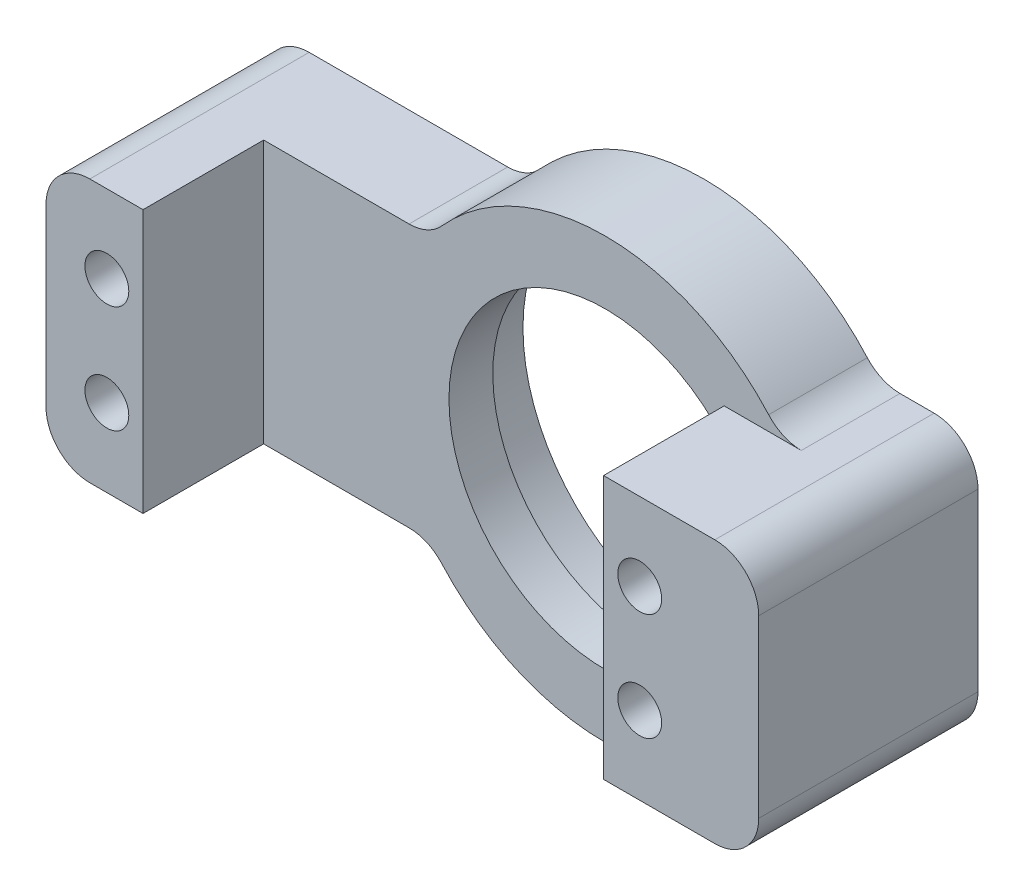
ISO-10303-21;
HEADER;
FILE_DESCRIPTION(('STEP AP214'),'2;1');
FILE_NAME('part.step','',(''),(''),'','','');
FILE_SCHEMA(('AUTOMOTIVE_DESIGN { 1 0 10303 214 1 1 1 1 }'));
ENDSEC;
DATA;
#1=APPLICATION_CONTEXT('core data for automotive mechanical design processes');
#2=APPLICATION_PROTOCOL_DEFINITION('international standard','automotive_design',2000,#1);
#3=PRODUCT_CONTEXT('',#1,'mechanical');
#4=PRODUCT('Part','Part','',(#3));
#5=PRODUCT_RELATED_PRODUCT_CATEGORY('part','',(#4));
#6=PRODUCT_DEFINITION_FORMATION('','',#4);
#7=PRODUCT_DEFINITION_CONTEXT('part definition',#1,'design');
#8=PRODUCT_DEFINITION('design','',#6,#7);
#9=PRODUCT_DEFINITION_SHAPE('','',#8);
#10=(LENGTH_UNIT() NAMED_UNIT(*) SI_UNIT(.MILLI.,.METRE.));
#11=(NAMED_UNIT(*) PLANE_ANGLE_UNIT() SI_UNIT($,.RADIAN.));
#12=(NAMED_UNIT(*) SI_UNIT($,.STERADIAN.) SOLID_ANGLE_UNIT());
#13=UNCERTAINTY_MEASURE_WITH_UNIT(LENGTH_MEASURE(1.E-05),#10,'distance_accuracy_value','');
#14=(GEOMETRIC_REPRESENTATION_CONTEXT(3) GLOBAL_UNCERTAINTY_ASSIGNED_CONTEXT((#13)) GLOBAL_UNIT_ASSIGNED_CONTEXT((#10,
#11,#12)) REPRESENTATION_CONTEXT('',''));
#15=CARTESIAN_POINT('',(0.,0.,0.));
#16=DIRECTION('',(0.,0.,1.));
#17=DIRECTION('',(1.,0.,0.));
#18=AXIS2_PLACEMENT_3D('',#15,#16,#17);
#19=CARTESIAN_POINT('',(0.,113.007283518404,9.));
#20=DIRECTION('',(0.,0.,1.));
#21=DIRECTION('',(1.,0.,0.));
#22=AXIS2_PLACEMENT_3D('',#19,#20,#21);
#23=PLANE('',#22);
#24=CARTESIAN_POINT('',(0.,113.007283518404,9.));
#25=DIRECTION('',(0.,0.,1.));
#26=DIRECTION('',(1.,0.,0.));
#27=AXIS2_PLACEMENT_3D('',#24,#25,#26);
#28=CIRCLE('',#27,20.);
#29=CARTESIAN_POINT('',(14.9071198499986,126.340616851737,9.));
#30=VERTEX_POINT('',#29);
#31=CARTESIAN_POINT('',(-14.9071198499986,126.340616851737,9.));
#32=VERTEX_POINT('',#31);
#33=EDGE_CURVE('E250',#30,#32,#28,.T.);
#34=ORIENTED_EDGE('',*,*,#33,.T.);
#35=CARTESIAN_POINT('',(-17.8885438199983,129.007283518404,9.));
#36=DIRECTION('',(0.,0.,1.));
#37=DIRECTION('',(1.,0.,0.));
#38=AXIS2_PLACEMENT_3D('',#35,#36,#37);
#39=CIRCLE('',#38,4.);
#40=CARTESIAN_POINT('',(-17.8885438199983,125.007283518404,9.));
#41=VERTEX_POINT('',#40);
#42=EDGE_CURVE('E341',#32,#41,#39,.F.);
#43=ORIENTED_EDGE('',*,*,#42,.T.);
#44=DIRECTION('',(-1.,0.,0.));
#45=VECTOR('',#44,1.);
#46=CARTESIAN_POINT('',(-16.,125.007283518404,9.));
#47=LINE('',#46,#45);
#48=CARTESIAN_POINT('',(-31.1499999999761,125.007283518404,9.));
#49=VERTEX_POINT('',#48);
#50=EDGE_CURVE('E253',#41,#49,#47,.T.);
#51=ORIENTED_EDGE('',*,*,#50,.T.);
#52=DIRECTION('',(0.,1.,0.));
#53=VECTOR('',#52,1.);
#54=CARTESIAN_POINT('',(-31.1499999999761,125.007283518404,9.));
#55=LINE('',#54,#53);
#56=CARTESIAN_POINT('',(-31.1499999999761,101.007283518404,9.));
#57=VERTEX_POINT('',#56);
#58=EDGE_CURVE('E211',#57,#49,#55,.T.);
#59=ORIENTED_EDGE('',*,*,#58,.F.);
#60=DIRECTION('',(1.,0.,0.));
#61=VECTOR('',#60,1.);
#62=CARTESIAN_POINT('',(-40.,101.007283518404,9.));
#63=LINE('',#62,#61);
#64=CARTESIAN_POINT('',(-17.8885438199984,101.007283518404,9.));
#65=VERTEX_POINT('',#64);
#66=EDGE_CURVE('E197',#57,#65,#63,.T.);
#67=ORIENTED_EDGE('',*,*,#66,.T.);
#68=CARTESIAN_POINT('',(-17.8885438199984,97.0072835184039,9.));
#69=DIRECTION('',(0.,0.,1.));
#70=DIRECTION('',(1.,0.,0.));
#71=AXIS2_PLACEMENT_3D('',#68,#69,#70);
#72=CIRCLE('',#71,4.);
#73=CARTESIAN_POINT('',(-14.9071198499986,99.6739501850705,9.));
#74=VERTEX_POINT('',#73);
#75=EDGE_CURVE('E345',#65,#74,#72,.F.);
#76=ORIENTED_EDGE('',*,*,#75,.T.);
#77=CARTESIAN_POINT('',(0.,113.007283518404,9.));
#78=DIRECTION('',(0.,0.,1.));
#79=DIRECTION('',(1.,0.,0.));
#80=AXIS2_PLACEMENT_3D('',#77,#78,#79);
#81=CIRCLE('',#80,20.);
#82=CARTESIAN_POINT('',(14.9071198499986,99.6739501850705,9.));
#83=VERTEX_POINT('',#82);
#84=EDGE_CURVE('E247',#74,#83,#81,.T.);
#85=ORIENTED_EDGE('',*,*,#84,.T.);
#86=CARTESIAN_POINT('',(17.8885438199983,97.0072835184039,9.));
#87=DIRECTION('',(0.,0.,1.));
#88=DIRECTION('',(1.,0.,0.));
#89=AXIS2_PLACEMENT_3D('',#86,#87,#88);
#90=CIRCLE('',#89,4.);
#91=CARTESIAN_POINT('',(17.8885438199983,101.007283518404,9.));
#92=VERTEX_POINT('',#91);
#93=EDGE_CURVE('E11',#83,#92,#90,.F.);
#94=ORIENTED_EDGE('',*,*,#93,.T.);
#95=DIRECTION('',(1.,0.,0.));
#96=VECTOR('',#95,1.);
#97=CARTESIAN_POINT('',(25.,101.007283518404,9.));
#98=LINE('',#97,#96);
#99=CARTESIAN_POINT('',(10.8500000000239,101.007283518404,9.));
#100=VERTEX_POINT('',#99);
#101=EDGE_CURVE('E218',#100,#92,#98,.T.);
#102=ORIENTED_EDGE('',*,*,#101,.F.);
#103=DIRECTION('',(0.,-1.,0.));
#104=VECTOR('',#103,1.);
#105=CARTESIAN_POINT('',(10.8500000000239,101.007283518404,9.));
#106=LINE('',#105,#104);
#107=CARTESIAN_POINT('',(10.8500000000239,103.769318374527,9.));
#108=VERTEX_POINT('',#107);
#109=EDGE_CURVE('E228',#108,#100,#106,.T.);
#110=ORIENTED_EDGE('',*,*,#109,.F.);
#111=CARTESIAN_POINT('',(0.,113.007283518404,9.));
#112=DIRECTION('',(0.,0.,1.));
#113=DIRECTION('',(1.,0.,0.));
#114=AXIS2_PLACEMENT_3D('',#111,#112,#113);
#115=CIRCLE('',#114,14.25);
#116=CARTESIAN_POINT('',(10.8500000000239,122.245248662281,9.));
#117=VERTEX_POINT('',#116);
#118=EDGE_CURVE('E240',#117,#108,#115,.T.);
#119=ORIENTED_EDGE('',*,*,#118,.F.);
#120=CARTESIAN_POINT('',(10.8500000000239,125.007283518404,9.));
#121=VERTEX_POINT('',#120);
#122=EDGE_CURVE('E230',#121,#117,#106,.T.);
#123=ORIENTED_EDGE('',*,*,#122,.F.);
#124=DIRECTION('',(-1.,0.,0.));
#125=VECTOR('',#124,1.);
#126=CARTESIAN_POINT('',(25.,125.007283518404,9.));
#127=LINE('',#126,#125);
#128=CARTESIAN_POINT('',(17.8885438199983,125.007283518404,9.));
#129=VERTEX_POINT('',#128);
#130=EDGE_CURVE('E225',#129,#121,#127,.T.);
#131=ORIENTED_EDGE('',*,*,#130,.F.);
#132=CARTESIAN_POINT('',(17.8885438199983,129.007283518404,9.));
#133=DIRECTION('',(0.,0.,1.));
#134=DIRECTION('',(1.,0.,0.));
#135=AXIS2_PLACEMENT_3D('',#132,#133,#134);
#136=CIRCLE('',#135,4.);
#137=EDGE_CURVE('E337',#129,#30,#136,.F.);
#138=ORIENTED_EDGE('',*,*,#137,.T.);
#139=EDGE_LOOP('',(#34,#43,#51,#59,#67,#76,#85,#94,#102,#110,#119,#123,#131,#138));
#140=FACE_BOUND('',#139,.T.);
#141=ADVANCED_FACE('F32',(#140),#23,.T.);
#142=CARTESIAN_POINT('',(0.,113.007283518404,0.));
#143=DIRECTION('',(0.,0.,1.));
#144=DIRECTION('',(1.,0.,0.));
#145=AXIS2_PLACEMENT_3D('',#142,#143,#144);
#146=PLANE('',#145);
#147=DIRECTION('',(1.,0.,0.));
#148=VECTOR('',#147,1.);
#149=CARTESIAN_POINT('',(-40.,101.007283518404,0.));
#150=LINE('',#149,#148);
#151=CARTESIAN_POINT('',(-36.,101.007283518404,0.));
#152=VERTEX_POINT('',#151);
#153=CARTESIAN_POINT('',(-17.8885438199984,101.007283518404,0.));
#154=VERTEX_POINT('',#153);
#155=EDGE_CURVE('E264',#152,#154,#150,.T.);
#156=ORIENTED_EDGE('',*,*,#155,.F.);
#157=CARTESIAN_POINT('',(-36.,105.007283518404,0.));
#158=DIRECTION('',(0.,0.,1.));
#159=DIRECTION('',(1.,0.,0.));
#160=AXIS2_PLACEMENT_3D('',#157,#158,#159);
#161=CIRCLE('',#160,4.);
#162=CARTESIAN_POINT('',(-40.,105.007283518404,0.));
#163=VERTEX_POINT('',#162);
#164=EDGE_CURVE('E318',#152,#163,#161,.F.);
#165=ORIENTED_EDGE('',*,*,#164,.T.);
#166=DIRECTION('',(0.,-1.,0.));
#167=VECTOR('',#166,1.);
#168=CARTESIAN_POINT('',(-40.,125.007283518404,0.));
#169=LINE('',#168,#167);
#170=CARTESIAN_POINT('',(-40.,121.007283518404,0.));
#171=VERTEX_POINT('',#170);
#172=EDGE_CURVE('E261',#171,#163,#169,.T.);
#173=ORIENTED_EDGE('',*,*,#172,.F.);
#174=CARTESIAN_POINT('',(-36.,121.007283518404,0.));
#175=DIRECTION('',(0.,0.,1.));
#176=DIRECTION('',(1.,0.,0.));
#177=AXIS2_PLACEMENT_3D('',#174,#175,#176);
#178=CIRCLE('',#177,4.);
#179=CARTESIAN_POINT('',(-36.,125.007283518404,0.));
#180=VERTEX_POINT('',#179);
#181=EDGE_CURVE('E316',#171,#180,#178,.F.);
#182=ORIENTED_EDGE('',*,*,#181,.T.);
#183=DIRECTION('',(-1.,0.,0.));
#184=VECTOR('',#183,1.);
#185=CARTESIAN_POINT('',(-40.,125.007283518404,0.));
#186=LINE('',#185,#184);
#187=CARTESIAN_POINT('',(-17.8885438199983,125.007283518404,0.));
#188=VERTEX_POINT('',#187);
#189=EDGE_CURVE('E229',#188,#180,#186,.T.);
#190=ORIENTED_EDGE('',*,*,#189,.F.);
#191=CARTESIAN_POINT('',(-17.8885438199983,129.007283518404,0.));
#192=DIRECTION('',(0.,0.,1.));
#193=DIRECTION('',(1.,0.,0.));
#194=AXIS2_PLACEMENT_3D('',#191,#192,#193);
#195=CIRCLE('',#194,4.);
#196=CARTESIAN_POINT('',(-14.9071198499986,126.340616851737,0.));
#197=VERTEX_POINT('',#196);
#198=EDGE_CURVE('E339',#188,#197,#195,.T.);
#199=ORIENTED_EDGE('',*,*,#198,.T.);
#200=CARTESIAN_POINT('',(0.,113.007283518404,0.));
#201=DIRECTION('',(0.,0.,1.));
#202=DIRECTION('',(1.,0.,0.));
#203=AXIS2_PLACEMENT_3D('',#200,#201,#202);
#204=CIRCLE('',#203,20.);
#205=CARTESIAN_POINT('',(14.9071198499986,126.340616851737,0.));
#206=VERTEX_POINT('',#205);
#207=EDGE_CURVE('E277',#206,#197,#204,.T.);
#208=ORIENTED_EDGE('',*,*,#207,.F.);
#209=CARTESIAN_POINT('',(17.8885438199983,129.007283518404,0.));
#210=DIRECTION('',(0.,0.,1.));
#211=DIRECTION('',(1.,0.,0.));
#212=AXIS2_PLACEMENT_3D('',#209,#210,#211);
#213=CIRCLE('',#212,4.);
#214=CARTESIAN_POINT('',(17.8885438199983,125.007283518404,0.));
#215=VERTEX_POINT('',#214);
#216=EDGE_CURVE('E335',#206,#215,#213,.T.);
#217=ORIENTED_EDGE('',*,*,#216,.T.);
#218=DIRECTION('',(-1.,0.,0.));
#219=VECTOR('',#218,1.);
#220=CARTESIAN_POINT('',(16.,125.007283518404,0.));
#221=LINE('',#220,#219);
#222=CARTESIAN_POINT('',(21.,125.007283518404,0.));
#223=VERTEX_POINT('',#222);
#224=EDGE_CURVE('E274',#223,#215,#221,.T.);
#225=ORIENTED_EDGE('',*,*,#224,.F.);
#226=CARTESIAN_POINT('',(21.,121.007283518404,0.));
#227=DIRECTION('',(0.,0.,1.));
#228=DIRECTION('',(1.,0.,0.));
#229=AXIS2_PLACEMENT_3D('',#226,#227,#228);
#230=CIRCLE('',#229,4.);
#231=CARTESIAN_POINT('',(25.,121.007283518404,0.));
#232=VERTEX_POINT('',#231);
#233=EDGE_CURVE('E314',#223,#232,#230,.F.);
#234=ORIENTED_EDGE('',*,*,#233,.T.);
#235=DIRECTION('',(0.,1.,0.));
#236=VECTOR('',#235,1.);
#237=CARTESIAN_POINT('',(25.,125.007283518404,0.));
#238=LINE('',#237,#236);
#239=CARTESIAN_POINT('',(25.,105.007283518404,0.));
#240=VERTEX_POINT('',#239);
#241=EDGE_CURVE('E272',#240,#232,#238,.T.);
#242=ORIENTED_EDGE('',*,*,#241,.F.);
#243=CARTESIAN_POINT('',(21.,105.007283518404,0.));
#244=DIRECTION('',(0.,0.,1.));
#245=DIRECTION('',(1.,0.,0.));
#246=AXIS2_PLACEMENT_3D('',#243,#244,#245);
#247=CIRCLE('',#246,4.);
#248=CARTESIAN_POINT('',(21.,101.007283518404,0.));
#249=VERTEX_POINT('',#248);
#250=EDGE_CURVE('E312',#240,#249,#247,.F.);
#251=ORIENTED_EDGE('',*,*,#250,.T.);
#252=DIRECTION('',(1.,0.,0.));
#253=VECTOR('',#252,1.);
#254=CARTESIAN_POINT('',(16.,101.007283518404,0.));
#255=LINE('',#254,#253);
#256=CARTESIAN_POINT('',(17.8885438199983,101.007283518404,0.));
#257=VERTEX_POINT('',#256);
#258=EDGE_CURVE('E269',#257,#249,#255,.T.);
#259=ORIENTED_EDGE('',*,*,#258,.F.);
#260=CARTESIAN_POINT('',(17.8885438199983,97.0072835184039,0.));
#261=DIRECTION('',(0.,0.,1.));
#262=DIRECTION('',(1.,0.,0.));
#263=AXIS2_PLACEMENT_3D('',#260,#261,#262);
#264=CIRCLE('',#263,4.);
#265=CARTESIAN_POINT('',(14.9071198499986,99.6739501850705,0.));
#266=VERTEX_POINT('',#265);
#267=EDGE_CURVE('E40',#257,#266,#264,.T.);
#268=ORIENTED_EDGE('',*,*,#267,.T.);
#269=CARTESIAN_POINT('',(0.,113.007283518404,0.));
#270=DIRECTION('',(0.,0.,1.));
#271=DIRECTION('',(1.,0.,0.));
#272=AXIS2_PLACEMENT_3D('',#269,#270,#271);
#273=CIRCLE('',#272,20.);
#274=CARTESIAN_POINT('',(-14.9071198499986,99.6739501850705,0.));
#275=VERTEX_POINT('',#274);
#276=EDGE_CURVE('E266',#275,#266,#273,.T.);
#277=ORIENTED_EDGE('',*,*,#276,.F.);
#278=CARTESIAN_POINT('',(-17.8885438199984,97.0072835184039,0.));
#279=DIRECTION('',(0.,0.,1.));
#280=DIRECTION('',(1.,0.,0.));
#281=AXIS2_PLACEMENT_3D('',#278,#279,#280);
#282=CIRCLE('',#281,4.);
#283=EDGE_CURVE('E343',#275,#154,#282,.T.);
#284=ORIENTED_EDGE('',*,*,#283,.T.);
#285=EDGE_LOOP('',(#156,#165,#173,#182,#190,#199,#208,#217,#225,#234,#242,#251,#259,#268,#277,#284));
#286=FACE_BOUND('',#285,.T.);
#287=CARTESIAN_POINT('',(0.,113.007283518404,0.));
#288=DIRECTION('',(0.,0.,1.));
#289=DIRECTION('',(1.,0.,0.));
#290=AXIS2_PLACEMENT_3D('',#287,#288,#289);
#291=CIRCLE('',#290,16.5);
#292=CARTESIAN_POINT('',(16.5,113.007283518404,0.));
#293=VERTEX_POINT('',#292);
#294=EDGE_CURVE('E258',#293,#293,#291,.T.);
#295=ORIENTED_EDGE('',*,*,#294,.T.);
#296=EDGE_LOOP('',(#295));
#297=FACE_BOUND('',#296,.T.);
#298=ADVANCED_FACE('F350',(#286,#297),#146,.F.);
#299=CARTESIAN_POINT('',(-40.,125.007283518404,5.));
#300=DIRECTION('',(1.,0.,0.));
#301=DIRECTION('',(0.,0.,-1.));
#302=AXIS2_PLACEMENT_3D('',#299,#300,#301);
#303=PLANE('',#302);
#304=ORIENTED_EDGE('',*,*,#172,.T.);
#305=DIRECTION('',(0.,0.,-1.));
#306=VECTOR('',#305,1.);
#307=CARTESIAN_POINT('',(-40.,105.007283518404,5.));
#308=LINE('',#307,#306);
#309=CARTESIAN_POINT('',(-40.,105.007283518404,20.));
#310=VERTEX_POINT('',#309);
#311=EDGE_CURVE('E323',#163,#310,#308,.F.);
#312=ORIENTED_EDGE('',*,*,#311,.T.);
#313=DIRECTION('',(0.,-1.,0.));
#314=VECTOR('',#313,1.);
#315=CARTESIAN_POINT('',(-40.,125.007283518404,20.));
#316=LINE('',#315,#314);
#317=CARTESIAN_POINT('',(-40.,121.007283518404,20.));
#318=VERTEX_POINT('',#317);
#319=EDGE_CURVE('E189',#318,#310,#316,.T.);
#320=ORIENTED_EDGE('',*,*,#319,.F.);
#321=DIRECTION('',(0.,0.,-1.));
#322=VECTOR('',#321,1.);
#323=CARTESIAN_POINT('',(-40.,121.007283518404,5.));
#324=LINE('',#323,#322);
#325=EDGE_CURVE('E320',#318,#171,#324,.T.);
#326=ORIENTED_EDGE('',*,*,#325,.T.);
#327=EDGE_LOOP('',(#304,#312,#320,#326));
#328=FACE_BOUND('',#327,.T.);
#329=ADVANCED_FACE('F372',(#328),#303,.F.);
#330=CARTESIAN_POINT('',(-40.,101.007283518404,5.));
#331=DIRECTION('',(0.,1.,0.));
#332=DIRECTION('',(0.,0.,1.));
#333=AXIS2_PLACEMENT_3D('',#330,#331,#332);
#334=PLANE('',#333);
#335=ORIENTED_EDGE('',*,*,#155,.T.);
#336=DIRECTION('',(0.,0.,1.));
#337=VECTOR('',#336,1.);
#338=CARTESIAN_POINT('',(-17.8885438199984,101.007283518404,9.));
#339=LINE('',#338,#337);
#340=EDGE_CURVE('E305',#154,#65,#339,.T.);
#341=ORIENTED_EDGE('',*,*,#340,.T.);
#342=ORIENTED_EDGE('',*,*,#66,.F.);
#343=DIRECTION('',(0.,0.,-1.));
#344=VECTOR('',#343,1.);
#345=CARTESIAN_POINT('',(-31.1499999999761,101.007283518404,20.));
#346=LINE('',#345,#344);
#347=CARTESIAN_POINT('',(-31.1499999999761,101.007283518404,20.));
#348=VERTEX_POINT('',#347);
#349=EDGE_CURVE('E193',#348,#57,#346,.T.);
#350=ORIENTED_EDGE('',*,*,#349,.F.);
#351=DIRECTION('',(1.,0.,0.));
#352=VECTOR('',#351,1.);
#353=CARTESIAN_POINT('',(-40.,101.007283518404,20.));
#354=LINE('',#353,#352);
#355=CARTESIAN_POINT('',(-36.,101.007283518404,20.));
#356=VERTEX_POINT('',#355);
#357=EDGE_CURVE('E176',#356,#348,#354,.T.);
#358=ORIENTED_EDGE('',*,*,#357,.F.);
#359=DIRECTION('',(0.,0.,-1.));
#360=VECTOR('',#359,1.);
#361=CARTESIAN_POINT('',(-36.,101.007283518404,5.));
#362=LINE('',#361,#360);
#363=EDGE_CURVE('E303',#356,#152,#362,.T.);
#364=ORIENTED_EDGE('',*,*,#363,.T.);
#365=EDGE_LOOP('',(#335,#341,#342,#350,#358,#364));
#366=FACE_BOUND('',#365,.T.);
#367=ADVANCED_FACE('F195',(#366),#334,.F.);
#368=CARTESIAN_POINT('',(0.,113.007283518404,5.));
#369=DIRECTION('',(0.,0.,-1.));
#370=DIRECTION('',(-1.,0.,0.));
#371=AXIS2_PLACEMENT_3D('',#368,#369,#370);
#372=CYLINDRICAL_SURFACE('',#371,20.);
#373=ORIENTED_EDGE('',*,*,#84,.F.);
#374=DIRECTION('',(0.,0.,-1.));
#375=VECTOR('',#374,1.);
#376=CARTESIAN_POINT('',(-14.9071198499986,99.6739501850705,5.));
#377=LINE('',#376,#375);
#378=EDGE_CURVE('E300',#74,#275,#377,.T.);
#379=ORIENTED_EDGE('',*,*,#378,.T.);
#380=ORIENTED_EDGE('',*,*,#276,.T.);
#381=DIRECTION('',(0.,0.,-1.));
#382=VECTOR('',#381,1.);
#383=CARTESIAN_POINT('',(14.9071198499986,99.6739501850705,5.));
#384=LINE('',#383,#382);
#385=EDGE_CURVE('E298',#266,#83,#384,.F.);
#386=ORIENTED_EDGE('',*,*,#385,.T.);
#387=EDGE_LOOP('',(#373,#379,#380,#386));
#388=FACE_BOUND('',#387,.T.);
#389=ADVANCED_FACE('F357',(#388),#372,.T.);
#390=CARTESIAN_POINT('',(16.,101.007283518404,5.));
#391=DIRECTION('',(0.,1.,0.));
#392=DIRECTION('',(0.,0.,1.));
#393=AXIS2_PLACEMENT_3D('',#390,#391,#392);
#394=PLANE('',#393);
#395=ORIENTED_EDGE('',*,*,#101,.T.);
#396=DIRECTION('',(0.,0.,1.));
#397=VECTOR('',#396,1.);
#398=CARTESIAN_POINT('',(17.8885438199983,101.007283518404,0.));
#399=LINE('',#398,#397);
#400=EDGE_CURVE('E309',#92,#257,#399,.F.);
#401=ORIENTED_EDGE('',*,*,#400,.T.);
#402=ORIENTED_EDGE('',*,*,#258,.T.);
#403=DIRECTION('',(0.,0.,-1.));
#404=VECTOR('',#403,1.);
#405=CARTESIAN_POINT('',(21.,101.007283518404,5.));
#406=LINE('',#405,#404);
#407=CARTESIAN_POINT('',(21.,101.007283518404,20.));
#408=VERTEX_POINT('',#407);
#409=EDGE_CURVE('E307',#249,#408,#406,.F.);
#410=ORIENTED_EDGE('',*,*,#409,.T.);
#411=DIRECTION('',(1.,0.,0.));
#412=VECTOR('',#411,1.);
#413=CARTESIAN_POINT('',(25.,101.007283518404,20.));
#414=LINE('',#413,#412);
#415=CARTESIAN_POINT('',(10.8500000000239,101.007283518404,20.));
#416=VERTEX_POINT('',#415);
#417=EDGE_CURVE('E222',#416,#408,#414,.T.);
#418=ORIENTED_EDGE('',*,*,#417,.F.);
#419=DIRECTION('',(0.,0.,-1.));
#420=VECTOR('',#419,1.);
#421=CARTESIAN_POINT('',(10.8500000000239,101.007283518404,20.));
#422=LINE('',#421,#420);
#423=EDGE_CURVE('E224',#416,#100,#422,.T.);
#424=ORIENTED_EDGE('',*,*,#423,.T.);
#425=EDGE_LOOP('',(#395,#401,#402,#410,#418,#424));
#426=FACE_BOUND('',#425,.T.);
#427=ADVANCED_FACE('F412',(#426),#394,.F.);
#428=CARTESIAN_POINT('',(25.,125.007283518404,5.));
#429=DIRECTION('',(-1.,0.,0.));
#430=DIRECTION('',(0.,0.,1.));
#431=AXIS2_PLACEMENT_3D('',#428,#429,#430);
#432=PLANE('',#431);
#433=ORIENTED_EDGE('',*,*,#241,.T.);
#434=DIRECTION('',(0.,0.,-1.));
#435=VECTOR('',#434,1.);
#436=CARTESIAN_POINT('',(25.,121.007283518404,5.));
#437=LINE('',#436,#435);
#438=CARTESIAN_POINT('',(25.,121.007283518404,20.));
#439=VERTEX_POINT('',#438);
#440=EDGE_CURVE('E47',#232,#439,#437,.F.);
#441=ORIENTED_EDGE('',*,*,#440,.T.);
#442=DIRECTION('',(0.,1.,0.));
#443=VECTOR('',#442,1.);
#444=CARTESIAN_POINT('',(25.,101.007283518404,20.));
#445=LINE('',#444,#443);
#446=CARTESIAN_POINT('',(25.,105.007283518404,20.));
#447=VERTEX_POINT('',#446);
#448=EDGE_CURVE('E215',#447,#439,#445,.T.);
#449=ORIENTED_EDGE('',*,*,#448,.F.);
#450=DIRECTION('',(0.,0.,-1.));
#451=VECTOR('',#450,1.);
#452=CARTESIAN_POINT('',(25.,105.007283518404,5.));
#453=LINE('',#452,#451);
#454=EDGE_CURVE('E328',#447,#240,#453,.T.);
#455=ORIENTED_EDGE('',*,*,#454,.T.);
#456=EDGE_LOOP('',(#433,#441,#449,#455));
#457=FACE_BOUND('',#456,.T.);
#458=ADVANCED_FACE('F407',(#457),#432,.F.);
#459=CARTESIAN_POINT('',(16.,125.007283518404,5.));
#460=DIRECTION('',(0.,-1.,0.));
#461=DIRECTION('',(0.,0.,-1.));
#462=AXIS2_PLACEMENT_3D('',#459,#460,#461);
#463=PLANE('',#462);
#464=ORIENTED_EDGE('',*,*,#224,.T.);
#465=DIRECTION('',(0.,0.,1.));
#466=VECTOR('',#465,1.);
#467=CARTESIAN_POINT('',(17.8885438199983,125.007283518404,9.));
#468=LINE('',#467,#466);
#469=EDGE_CURVE('E290',#215,#129,#468,.T.);
#470=ORIENTED_EDGE('',*,*,#469,.T.);
#471=ORIENTED_EDGE('',*,*,#130,.T.);
#472=DIRECTION('',(0.,0.,-1.));
#473=VECTOR('',#472,1.);
#474=CARTESIAN_POINT('',(10.8500000000239,125.007283518404,20.));
#475=LINE('',#474,#473);
#476=CARTESIAN_POINT('',(10.8500000000239,125.007283518404,20.));
#477=VERTEX_POINT('',#476);
#478=EDGE_CURVE('E236',#477,#121,#475,.T.);
#479=ORIENTED_EDGE('',*,*,#478,.F.);
#480=DIRECTION('',(-1.,0.,0.));
#481=VECTOR('',#480,1.);
#482=CARTESIAN_POINT('',(25.,125.007283518404,20.));
#483=LINE('',#482,#481);
#484=CARTESIAN_POINT('',(21.,125.007283518404,20.));
#485=VERTEX_POINT('',#484);
#486=EDGE_CURVE('E217',#485,#477,#483,.T.);
#487=ORIENTED_EDGE('',*,*,#486,.F.);
#488=DIRECTION('',(0.,0.,-1.));
#489=VECTOR('',#488,1.);
#490=CARTESIAN_POINT('',(21.,125.007283518404,5.));
#491=LINE('',#490,#489);
#492=EDGE_CURVE('E287',#485,#223,#491,.T.);
#493=ORIENTED_EDGE('',*,*,#492,.T.);
#494=EDGE_LOOP('',(#464,#470,#471,#479,#487,#493));
#495=FACE_BOUND('',#494,.T.);
#496=ADVANCED_FACE('F399',(#495),#463,.F.);
#497=CARTESIAN_POINT('',(0.,113.007283518404,5.));
#498=DIRECTION('',(0.,0.,-1.));
#499=DIRECTION('',(-1.,0.,0.));
#500=AXIS2_PLACEMENT_3D('',#497,#498,#499);
#501=CYLINDRICAL_SURFACE('',#500,20.);
#502=ORIENTED_EDGE('',*,*,#33,.F.);
#503=DIRECTION('',(0.,0.,-1.));
#504=VECTOR('',#503,1.);
#505=CARTESIAN_POINT('',(14.9071198499986,126.340616851737,5.));
#506=LINE('',#505,#504);
#507=EDGE_CURVE('E284',#30,#206,#506,.T.);
#508=ORIENTED_EDGE('',*,*,#507,.T.);
#509=ORIENTED_EDGE('',*,*,#207,.T.);
#510=DIRECTION('',(0.,0.,-1.));
#511=VECTOR('',#510,1.);
#512=CARTESIAN_POINT('',(-14.9071198499986,126.340616851737,5.));
#513=LINE('',#512,#511);
#514=EDGE_CURVE('E282',#197,#32,#513,.F.);
#515=ORIENTED_EDGE('',*,*,#514,.T.);
#516=EDGE_LOOP('',(#502,#508,#509,#515));
#517=FACE_BOUND('',#516,.T.);
#518=ADVANCED_FACE('F391',(#517),#501,.T.);
#519=CARTESIAN_POINT('',(-40.,125.007283518404,5.));
#520=DIRECTION('',(0.,-1.,0.));
#521=DIRECTION('',(0.,0.,-1.));
#522=AXIS2_PLACEMENT_3D('',#519,#520,#521);
#523=PLANE('',#522);
#524=ORIENTED_EDGE('',*,*,#50,.F.);
#525=DIRECTION('',(0.,0.,1.));
#526=VECTOR('',#525,1.);
#527=CARTESIAN_POINT('',(-17.8885438199983,125.007283518404,0.));
#528=LINE('',#527,#526);
#529=EDGE_CURVE('E295',#41,#188,#528,.F.);
#530=ORIENTED_EDGE('',*,*,#529,.T.);
#531=ORIENTED_EDGE('',*,*,#189,.T.);
#532=DIRECTION('',(0.,0.,-1.));
#533=VECTOR('',#532,1.);
#534=CARTESIAN_POINT('',(-36.,125.007283518404,5.));
#535=LINE('',#534,#533);
#536=CARTESIAN_POINT('',(-36.,125.007283518404,20.));
#537=VERTEX_POINT('',#536);
#538=EDGE_CURVE('E293',#180,#537,#535,.F.);
#539=ORIENTED_EDGE('',*,*,#538,.T.);
#540=DIRECTION('',(-1.,0.,0.));
#541=VECTOR('',#540,1.);
#542=CARTESIAN_POINT('',(-40.,125.007283518404,20.));
#543=LINE('',#542,#541);
#544=CARTESIAN_POINT('',(-31.1499999999761,125.007283518404,20.));
#545=VERTEX_POINT('',#544);
#546=EDGE_CURVE('E206',#545,#537,#543,.T.);
#547=ORIENTED_EDGE('',*,*,#546,.F.);
#548=DIRECTION('',(0.,0.,-1.));
#549=VECTOR('',#548,1.);
#550=CARTESIAN_POINT('',(-31.1499999999761,125.007283518404,20.));
#551=LINE('',#550,#549);
#552=EDGE_CURVE('E201',#545,#49,#551,.T.);
#553=ORIENTED_EDGE('',*,*,#552,.T.);
#554=EDGE_LOOP('',(#524,#530,#531,#539,#547,#553));
#555=FACE_BOUND('',#554,.T.);
#556=ADVANCED_FACE('F382',(#555),#523,.F.);
#557=CARTESIAN_POINT('',(0.,113.007283518404,5.));
#558=DIRECTION('',(0.,0.,-1.));
#559=DIRECTION('',(-1.,0.,0.));
#560=AXIS2_PLACEMENT_3D('',#557,#558,#559);
#561=CYLINDRICAL_SURFACE('',#560,16.5);
#562=CARTESIAN_POINT('',(0.,113.007283518404,5.));
#563=DIRECTION('',(0.,0.,1.));
#564=DIRECTION('',(1.,0.,0.));
#565=AXIS2_PLACEMENT_3D('',#562,#563,#564);
#566=CIRCLE('',#565,16.5);
#567=CARTESIAN_POINT('',(16.5,113.007283518404,5.));
#568=VERTEX_POINT('',#567);
#569=EDGE_CURVE('E255',#568,#568,#566,.T.);
#570=ORIENTED_EDGE('',*,*,#569,.T.);
#571=EDGE_LOOP('',(#570));
#572=FACE_BOUND('',#571,.T.);
#573=ORIENTED_EDGE('',*,*,#294,.F.);
#574=EDGE_LOOP('',(#573));
#575=FACE_BOUND('',#574,.T.);
#576=ADVANCED_FACE('F484',(#572,#575),#561,.F.);
#577=CARTESIAN_POINT('',(0.,113.007283518404,5.));
#578=DIRECTION('',(0.,0.,1.));
#579=DIRECTION('',(1.,0.,0.));
#580=AXIS2_PLACEMENT_3D('',#577,#578,#579);
#581=PLANE('',#580);
#582=CARTESIAN_POINT('',(0.,113.007283518404,5.));
#583=DIRECTION('',(0.,0.,1.));
#584=DIRECTION('',(1.,0.,0.));
#585=AXIS2_PLACEMENT_3D('',#582,#583,#584);
#586=CIRCLE('',#585,14.25);
#587=CARTESIAN_POINT('',(14.25,113.007283518404,5.));
#588=VERTEX_POINT('',#587);
#589=EDGE_CURVE('E239',#588,#588,#586,.T.);
#590=ORIENTED_EDGE('',*,*,#589,.T.);
#591=EDGE_LOOP('',(#590));
#592=FACE_BOUND('',#591,.T.);
#593=ORIENTED_EDGE('',*,*,#569,.F.);
#594=EDGE_LOOP('',(#593));
#595=FACE_BOUND('',#594,.T.);
#596=ADVANCED_FACE('F481',(#592,#595),#581,.F.);
#597=CARTESIAN_POINT('',(0.,113.007283518404,9.));
#598=DIRECTION('',(0.,0.,-1.));
#599=DIRECTION('',(-1.,0.,0.));
#600=AXIS2_PLACEMENT_3D('',#597,#598,#599);
#601=CYLINDRICAL_SURFACE('',#600,14.25);
#602=ORIENTED_EDGE('',*,*,#118,.T.);
#603=EDGE_CURVE('E243',#108,#117,#115,.T.);
#604=ORIENTED_EDGE('',*,*,#603,.T.);
#605=EDGE_LOOP('',(#602,#604));
#606=FACE_BOUND('',#605,.T.);
#607=ORIENTED_EDGE('',*,*,#589,.F.);
#608=EDGE_LOOP('',(#607));
#609=FACE_BOUND('',#608,.T.);
#610=ADVANCED_FACE('F423',(#606,#609),#601,.F.);
#611=CARTESIAN_POINT('',(10.8500000000239,101.007283518404,20.));
#612=DIRECTION('',(1.,0.,0.));
#613=DIRECTION('',(0.,0.,-1.));
#614=AXIS2_PLACEMENT_3D('',#611,#612,#613);
#615=PLANE('',#614);
#616=ORIENTED_EDGE('',*,*,#122,.T.);
#617=EDGE_CURVE('E200',#117,#108,#106,.T.);
#618=ORIENTED_EDGE('',*,*,#617,.T.);
#619=ORIENTED_EDGE('',*,*,#109,.T.);
#620=ORIENTED_EDGE('',*,*,#423,.F.);
#621=DIRECTION('',(0.,-1.,0.));
#622=VECTOR('',#621,1.);
#623=CARTESIAN_POINT('',(10.8500000000239,101.007283518404,20.));
#624=LINE('',#623,#622);
#625=EDGE_CURVE('E220',#477,#416,#624,.T.);
#626=ORIENTED_EDGE('',*,*,#625,.F.);
#627=ORIENTED_EDGE('',*,*,#478,.T.);
#628=EDGE_LOOP('',(#616,#618,#619,#620,#626,#627));
#629=FACE_BOUND('',#628,.T.);
#630=ADVANCED_FACE('F417',(#629),#615,.F.);
#631=CARTESIAN_POINT('',(0.,0.,20.));
#632=DIRECTION('',(0.,0.,1.));
#633=DIRECTION('',(1.,0.,0.));
#634=AXIS2_PLACEMENT_3D('',#631,#632,#633);
#635=PLANE('',#634);
#636=CARTESIAN_POINT('',(14.1500000000239,108.107283518406,20.));
#637=DIRECTION('',(0.,0.,1.));
#638=DIRECTION('',(1.,0.,0.));
#639=AXIS2_PLACEMENT_3D('',#636,#637,#638);
#640=CIRCLE('',#639,2.);
#641=CARTESIAN_POINT('',(16.1500000000239,108.107283518406,20.));
#642=VERTEX_POINT('',#641);
#643=EDGE_CURVE('E434',#642,#642,#640,.T.);
#644=ORIENTED_EDGE('',*,*,#643,.F.);
#645=EDGE_LOOP('',(#644));
#646=FACE_BOUND('',#645,.T.);
#647=CARTESIAN_POINT('',(14.1500000000239,117.907283518406,20.));
#648=DIRECTION('',(0.,0.,1.));
#649=DIRECTION('',(1.,0.,0.));
#650=AXIS2_PLACEMENT_3D('',#647,#648,#649);
#651=CIRCLE('',#650,2.);
#652=CARTESIAN_POINT('',(16.1500000000239,117.907283518406,20.));
#653=VERTEX_POINT('',#652);
#654=EDGE_CURVE('E446',#653,#653,#651,.T.);
#655=ORIENTED_EDGE('',*,*,#654,.F.);
#656=EDGE_LOOP('',(#655));
#657=FACE_BOUND('',#656,.T.);
#658=ORIENTED_EDGE('',*,*,#448,.T.);
#659=CARTESIAN_POINT('',(21.,121.007283518404,20.));
#660=DIRECTION('',(0.,0.,1.));
#661=DIRECTION('',(1.,0.,0.));
#662=AXIS2_PLACEMENT_3D('',#659,#660,#661);
#663=CIRCLE('',#662,4.);
#664=EDGE_CURVE('E333',#439,#485,#663,.T.);
#665=ORIENTED_EDGE('',*,*,#664,.T.);
#666=ORIENTED_EDGE('',*,*,#486,.T.);
#667=ORIENTED_EDGE('',*,*,#625,.T.);
#668=ORIENTED_EDGE('',*,*,#417,.T.);
#669=CARTESIAN_POINT('',(21.,105.007283518404,20.));
#670=DIRECTION('',(0.,0.,1.));
#671=DIRECTION('',(1.,0.,0.));
#672=AXIS2_PLACEMENT_3D('',#669,#670,#671);
#673=CIRCLE('',#672,4.);
#674=EDGE_CURVE('E54',#408,#447,#673,.T.);
#675=ORIENTED_EDGE('',*,*,#674,.T.);
#676=EDGE_LOOP('',(#658,#665,#666,#667,#668,#675));
#677=FACE_BOUND('',#676,.T.);
#678=ADVANCED_FACE('F461',(#646,#657,#677),#635,.T.);
#679=CARTESIAN_POINT('',(0.,0.,9.));
#680=DIRECTION('',(0.,0.,1.));
#681=DIRECTION('',(1.,0.,0.));
#682=AXIS2_PLACEMENT_3D('',#679,#680,#681);
#683=PLANE('',#682);
#684=ORIENTED_EDGE('',*,*,#603,.F.);
#685=ORIENTED_EDGE('',*,*,#617,.F.);
#686=EDGE_LOOP('',(#684,#685));
#687=FACE_BOUND('',#686,.T.);
#688=ADVANCED_FACE('F426',(#687),#683,.F.);
#689=CARTESIAN_POINT('',(-31.1499999999761,125.007283518404,20.));
#690=DIRECTION('',(-1.,0.,0.));
#691=DIRECTION('',(0.,-1.,0.));
#692=AXIS2_PLACEMENT_3D('',#689,#690,#691);
#693=PLANE('',#692);
#694=ORIENTED_EDGE('',*,*,#58,.T.);
#695=ORIENTED_EDGE('',*,*,#552,.F.);
#696=DIRECTION('',(0.,1.,0.));
#697=VECTOR('',#696,1.);
#698=CARTESIAN_POINT('',(-31.1499999999761,125.007283518404,20.));
#699=LINE('',#698,#697);
#700=EDGE_CURVE('E182',#348,#545,#699,.T.);
#701=ORIENTED_EDGE('',*,*,#700,.F.);
#702=ORIENTED_EDGE('',*,*,#349,.T.);
#703=EDGE_LOOP('',(#694,#695,#701,#702));
#704=FACE_BOUND('',#703,.T.);
#705=ADVANCED_FACE('F203',(#704),#693,.F.);
#706=CARTESIAN_POINT('',(0.,0.,20.));
#707=DIRECTION('',(0.,0.,1.));
#708=DIRECTION('',(1.,0.,0.));
#709=AXIS2_PLACEMENT_3D('',#706,#707,#708);
#710=PLANE('',#709);
#711=CARTESIAN_POINT('',(-34.4499999999761,117.907283518406,20.));
#712=DIRECTION('',(0.,0.,1.));
#713=DIRECTION('',(1.,0.,0.));
#714=AXIS2_PLACEMENT_3D('',#711,#712,#713);
#715=CIRCLE('',#714,2.);
#716=CARTESIAN_POINT('',(-32.4499999999761,117.907283518406,20.));
#717=VERTEX_POINT('',#716);
#718=EDGE_CURVE('E441',#717,#717,#715,.T.);
#719=ORIENTED_EDGE('',*,*,#718,.F.);
#720=EDGE_LOOP('',(#719));
#721=FACE_BOUND('',#720,.T.);
#722=CARTESIAN_POINT('',(-34.4499999999761,108.107283518406,20.));
#723=DIRECTION('',(0.,0.,1.));
#724=DIRECTION('',(1.,0.,0.));
#725=AXIS2_PLACEMENT_3D('',#722,#723,#724);
#726=CIRCLE('',#725,1.99999999999999);
#727=CARTESIAN_POINT('',(-32.4499999999761,108.107283518406,20.));
#728=VERTEX_POINT('',#727);
#729=EDGE_CURVE('E428',#728,#728,#726,.T.);
#730=ORIENTED_EDGE('',*,*,#729,.F.);
#731=EDGE_LOOP('',(#730));
#732=FACE_BOUND('',#731,.T.);
#733=ORIENTED_EDGE('',*,*,#319,.T.);
#734=CARTESIAN_POINT('',(-36.,105.007283518404,20.));
#735=DIRECTION('',(0.,0.,1.));
#736=DIRECTION('',(1.,0.,0.));
#737=AXIS2_PLACEMENT_3D('',#734,#735,#736);
#738=CIRCLE('',#737,4.);
#739=EDGE_CURVE('E185',#310,#356,#738,.T.);
#740=ORIENTED_EDGE('',*,*,#739,.T.);
#741=ORIENTED_EDGE('',*,*,#357,.T.);
#742=ORIENTED_EDGE('',*,*,#700,.T.);
#743=ORIENTED_EDGE('',*,*,#546,.T.);
#744=CARTESIAN_POINT('',(-36.,121.007283518404,20.));
#745=DIRECTION('',(0.,0.,1.));
#746=DIRECTION('',(1.,0.,0.));
#747=AXIS2_PLACEMENT_3D('',#744,#745,#746);
#748=CIRCLE('',#747,4.);
#749=EDGE_CURVE('E325',#537,#318,#748,.T.);
#750=ORIENTED_EDGE('',*,*,#749,.T.);
#751=EDGE_LOOP('',(#733,#740,#741,#742,#743,#750));
#752=FACE_BOUND('',#751,.T.);
#753=ADVANCED_FACE('F179',(#721,#732,#752),#710,.T.);
#754=CARTESIAN_POINT('',(17.8885438199983,129.007283518404,5.));
#755=DIRECTION('',(0.,0.,-1.));
#756=DIRECTION('',(-1.,0.,0.));
#757=AXIS2_PLACEMENT_3D('',#754,#755,#756);
#758=CYLINDRICAL_SURFACE('',#757,4.);
#759=ORIENTED_EDGE('',*,*,#137,.F.);
#760=ORIENTED_EDGE('',*,*,#469,.F.);
#761=ORIENTED_EDGE('',*,*,#216,.F.);
#762=ORIENTED_EDGE('',*,*,#507,.F.);
#763=EDGE_LOOP('',(#759,#760,#761,#762));
#764=FACE_BOUND('',#763,.T.);
#765=ADVANCED_FACE('F395',(#764),#758,.F.);
#766=CARTESIAN_POINT('',(-17.8885438199983,129.007283518404,5.));
#767=DIRECTION('',(0.,0.,-1.));
#768=DIRECTION('',(-1.,0.,0.));
#769=AXIS2_PLACEMENT_3D('',#766,#767,#768);
#770=CYLINDRICAL_SURFACE('',#769,4.);
#771=ORIENTED_EDGE('',*,*,#42,.F.);
#772=ORIENTED_EDGE('',*,*,#514,.F.);
#773=ORIENTED_EDGE('',*,*,#198,.F.);
#774=ORIENTED_EDGE('',*,*,#529,.F.);
#775=EDGE_LOOP('',(#771,#772,#773,#774));
#776=FACE_BOUND('',#775,.T.);
#777=ADVANCED_FACE('F386',(#776),#770,.F.);
#778=CARTESIAN_POINT('',(-17.8885438199984,97.0072835184039,5.));
#779=DIRECTION('',(0.,0.,-1.));
#780=DIRECTION('',(-1.,0.,0.));
#781=AXIS2_PLACEMENT_3D('',#778,#779,#780);
#782=CYLINDRICAL_SURFACE('',#781,4.);
#783=ORIENTED_EDGE('',*,*,#75,.F.);
#784=ORIENTED_EDGE('',*,*,#340,.F.);
#785=ORIENTED_EDGE('',*,*,#283,.F.);
#786=ORIENTED_EDGE('',*,*,#378,.F.);
#787=EDGE_LOOP('',(#783,#784,#785,#786));
#788=FACE_BOUND('',#787,.T.);
#789=ADVANCED_FACE('F365',(#788),#782,.F.);
#790=CARTESIAN_POINT('',(17.8885438199983,97.0072835184039,5.));
#791=DIRECTION('',(0.,0.,-1.));
#792=DIRECTION('',(-1.,0.,0.));
#793=AXIS2_PLACEMENT_3D('',#790,#791,#792);
#794=CYLINDRICAL_SURFACE('',#793,4.);
#795=ORIENTED_EDGE('',*,*,#93,.F.);
#796=ORIENTED_EDGE('',*,*,#385,.F.);
#797=ORIENTED_EDGE('',*,*,#267,.F.);
#798=ORIENTED_EDGE('',*,*,#400,.F.);
#799=EDGE_LOOP('',(#795,#796,#797,#798));
#800=FACE_BOUND('',#799,.T.);
#801=ADVANCED_FACE('F360',(#800),#794,.F.);
#802=CARTESIAN_POINT('',(-36.,105.007283518404,5.));
#803=DIRECTION('',(0.,0.,-1.));
#804=DIRECTION('',(-1.,0.,0.));
#805=AXIS2_PLACEMENT_3D('',#802,#803,#804);
#806=CYLINDRICAL_SURFACE('',#805,4.);
#807=ORIENTED_EDGE('',*,*,#739,.F.);
#808=ORIENTED_EDGE('',*,*,#311,.F.);
#809=ORIENTED_EDGE('',*,*,#164,.F.);
#810=ORIENTED_EDGE('',*,*,#363,.F.);
#811=EDGE_LOOP('',(#807,#808,#809,#810));
#812=FACE_BOUND('',#811,.T.);
#813=ADVANCED_FACE('F368',(#812),#806,.T.);
#814=CARTESIAN_POINT('',(-36.,121.007283518404,5.));
#815=DIRECTION('',(0.,0.,-1.));
#816=DIRECTION('',(-1.,0.,0.));
#817=AXIS2_PLACEMENT_3D('',#814,#815,#816);
#818=CYLINDRICAL_SURFACE('',#817,4.);
#819=ORIENTED_EDGE('',*,*,#749,.F.);
#820=ORIENTED_EDGE('',*,*,#538,.F.);
#821=ORIENTED_EDGE('',*,*,#181,.F.);
#822=ORIENTED_EDGE('',*,*,#325,.F.);
#823=EDGE_LOOP('',(#819,#820,#821,#822));
#824=FACE_BOUND('',#823,.T.);
#825=ADVANCED_FACE('F377',(#824),#818,.T.);
#826=CARTESIAN_POINT('',(21.,121.007283518404,5.));
#827=DIRECTION('',(0.,0.,-1.));
#828=DIRECTION('',(-1.,0.,0.));
#829=AXIS2_PLACEMENT_3D('',#826,#827,#828);
#830=CYLINDRICAL_SURFACE('',#829,4.);
#831=ORIENTED_EDGE('',*,*,#664,.F.);
#832=ORIENTED_EDGE('',*,*,#440,.F.);
#833=ORIENTED_EDGE('',*,*,#233,.F.);
#834=ORIENTED_EDGE('',*,*,#492,.F.);
#835=EDGE_LOOP('',(#831,#832,#833,#834));
#836=FACE_BOUND('',#835,.T.);
#837=ADVANCED_FACE('F405',(#836),#830,.T.);
#838=CARTESIAN_POINT('',(21.,105.007283518404,5.));
#839=DIRECTION('',(0.,0.,-1.));
#840=DIRECTION('',(-1.,0.,0.));
#841=AXIS2_PLACEMENT_3D('',#838,#839,#840);
#842=CYLINDRICAL_SURFACE('',#841,4.);
#843=ORIENTED_EDGE('',*,*,#674,.F.);
#844=ORIENTED_EDGE('',*,*,#409,.F.);
#845=ORIENTED_EDGE('',*,*,#250,.F.);
#846=ORIENTED_EDGE('',*,*,#454,.F.);
#847=EDGE_LOOP('',(#843,#844,#845,#846));
#848=FACE_BOUND('',#847,.T.);
#849=ADVANCED_FACE('F34',(#848),#842,.T.);
#850=CARTESIAN_POINT('',(-34.4499999999761,108.107283518406,12.));
#851=DIRECTION('',(0.,0.,1.));
#852=DIRECTION('',(1.,0.,0.));
#853=AXIS2_PLACEMENT_3D('',#850,#851,#852);
#854=CYLINDRICAL_SURFACE('',#853,1.99999999999999);
#855=CARTESIAN_POINT('',(-34.4499999999761,108.107283518406,12.));
#856=DIRECTION('',(0.,0.,1.));
#857=DIRECTION('',(1.,0.,0.));
#858=AXIS2_PLACEMENT_3D('',#855,#856,#857);
#859=CIRCLE('',#858,1.99999999999999);
#860=CARTESIAN_POINT('',(-32.4499999999761,108.107283518406,12.));
#861=VERTEX_POINT('',#860);
#862=EDGE_CURVE('E213',#861,#861,#859,.T.);
#863=ORIENTED_EDGE('',*,*,#862,.F.);
#864=EDGE_LOOP('',(#863));
#865=FACE_BOUND('',#864,.T.);
#866=ORIENTED_EDGE('',*,*,#729,.T.);
#867=EDGE_LOOP('',(#866));
#868=FACE_BOUND('',#867,.T.);
#869=ADVANCED_FACE('F520',(#865,#868),#854,.F.);
#870=CARTESIAN_POINT('',(-34.4499999999761,108.107283518406,12.));
#871=DIRECTION('',(0.,0.,1.));
#872=DIRECTION('',(1.,0.,0.));
#873=AXIS2_PLACEMENT_3D('',#870,#871,#872);
#874=PLANE('',#873);
#875=ORIENTED_EDGE('',*,*,#862,.T.);
#876=EDGE_LOOP('',(#875));
#877=FACE_BOUND('',#876,.T.);
#878=ADVANCED_FACE('F524',(#877),#874,.T.);
#879=CARTESIAN_POINT('',(-34.4499999999761,117.907283518406,12.));
#880=DIRECTION('',(0.,0.,1.));
#881=DIRECTION('',(1.,0.,0.));
#882=AXIS2_PLACEMENT_3D('',#879,#880,#881);
#883=CYLINDRICAL_SURFACE('',#882,2.);
#884=CARTESIAN_POINT('',(-34.4499999999761,117.907283518406,12.));
#885=DIRECTION('',(0.,0.,1.));
#886=DIRECTION('',(1.,0.,0.));
#887=AXIS2_PLACEMENT_3D('',#884,#885,#886);
#888=CIRCLE('',#887,2.);
#889=CARTESIAN_POINT('',(-32.4499999999761,117.907283518406,12.));
#890=VERTEX_POINT('',#889);
#891=EDGE_CURVE('E431',#890,#890,#888,.T.);
#892=ORIENTED_EDGE('',*,*,#891,.F.);
#893=EDGE_LOOP('',(#892));
#894=FACE_BOUND('',#893,.T.);
#895=ORIENTED_EDGE('',*,*,#718,.T.);
#896=EDGE_LOOP('',(#895));
#897=FACE_BOUND('',#896,.T.);
#898=ADVANCED_FACE('F530',(#894,#897),#883,.F.);
#899=CARTESIAN_POINT('',(-34.4499999999761,117.907283518406,12.));
#900=DIRECTION('',(0.,0.,1.));
#901=DIRECTION('',(1.,0.,0.));
#902=AXIS2_PLACEMENT_3D('',#899,#900,#901);
#903=PLANE('',#902);
#904=ORIENTED_EDGE('',*,*,#891,.T.);
#905=EDGE_LOOP('',(#904));
#906=FACE_BOUND('',#905,.T.);
#907=ADVANCED_FACE('F457',(#906),#903,.T.);
#908=CARTESIAN_POINT('',(14.1500000000239,117.907283518406,12.));
#909=DIRECTION('',(0.,0.,1.));
#910=DIRECTION('',(1.,0.,0.));
#911=AXIS2_PLACEMENT_3D('',#908,#909,#910);
#912=CYLINDRICAL_SURFACE('',#911,2.);
#913=CARTESIAN_POINT('',(14.1500000000239,117.907283518406,12.));
#914=DIRECTION('',(0.,0.,1.));
#915=DIRECTION('',(1.,0.,0.));
#916=AXIS2_PLACEMENT_3D('',#913,#914,#915);
#917=CIRCLE('',#916,2.);
#918=CARTESIAN_POINT('',(16.1500000000239,117.907283518406,12.));
#919=VERTEX_POINT('',#918);
#920=EDGE_CURVE('E438',#919,#919,#917,.T.);
#921=ORIENTED_EDGE('',*,*,#920,.F.);
#922=EDGE_LOOP('',(#921));
#923=FACE_BOUND('',#922,.T.);
#924=ORIENTED_EDGE('',*,*,#654,.T.);
#925=EDGE_LOOP('',(#924));
#926=FACE_BOUND('',#925,.T.);
#927=ADVANCED_FACE('F454',(#923,#926),#912,.F.);
#928=CARTESIAN_POINT('',(14.1500000000239,117.907283518406,12.));
#929=DIRECTION('',(0.,0.,1.));
#930=DIRECTION('',(1.,0.,0.));
#931=AXIS2_PLACEMENT_3D('',#928,#929,#930);
#932=PLANE('',#931);
#933=ORIENTED_EDGE('',*,*,#920,.T.);
#934=EDGE_LOOP('',(#933));
#935=FACE_BOUND('',#934,.T.);
#936=ADVANCED_FACE('F452',(#935),#932,.T.);
#937=CARTESIAN_POINT('',(14.1500000000239,108.107283518406,12.));
#938=DIRECTION('',(0.,0.,1.));
#939=DIRECTION('',(1.,0.,0.));
#940=AXIS2_PLACEMENT_3D('',#937,#938,#939);
#941=CYLINDRICAL_SURFACE('',#940,2.);
#942=CARTESIAN_POINT('',(14.1500000000239,108.107283518406,12.));
#943=DIRECTION('',(0.,0.,1.));
#944=DIRECTION('',(1.,0.,0.));
#945=AXIS2_PLACEMENT_3D('',#942,#943,#944);
#946=CIRCLE('',#945,2.);
#947=CARTESIAN_POINT('',(16.1500000000239,108.107283518406,12.));
#948=VERTEX_POINT('',#947);
#949=EDGE_CURVE('E437',#948,#948,#946,.T.);
#950=ORIENTED_EDGE('',*,*,#949,.F.);
#951=EDGE_LOOP('',(#950));
#952=FACE_BOUND('',#951,.T.);
#953=ORIENTED_EDGE('',*,*,#643,.T.);
#954=EDGE_LOOP('',(#953));
#955=FACE_BOUND('',#954,.T.);
#956=ADVANCED_FACE('F767',(#952,#955),#941,.F.);
#957=CARTESIAN_POINT('',(14.1500000000239,108.107283518406,12.));
#958=DIRECTION('',(0.,0.,1.));
#959=DIRECTION('',(1.,0.,0.));
#960=AXIS2_PLACEMENT_3D('',#957,#958,#959);
#961=PLANE('',#960);
#962=ORIENTED_EDGE('',*,*,#949,.T.);
#963=EDGE_LOOP('',(#962));
#964=FACE_BOUND('',#963,.T.);
#965=ADVANCED_FACE('F775',(#964),#961,.T.);
#966=CLOSED_SHELL('',(#141,#298,#329,#367,#389,#427,#458,#496,#518,#556,#576,#596,#610,#630,
#678,#688,#705,#753,#765,#777,#789,#801,#813,#825,#837,#849,#869,#878,#898,#907,#927,#936,#956,#965));
#967=MANIFOLD_SOLID_BREP('B2',#966);
#968=ADVANCED_BREP_SHAPE_REPRESENTATION('',(#18,#967),#14);
#969=SHAPE_DEFINITION_REPRESENTATION(#9,#968);
ENDSEC;
END-ISO-10303-21;
